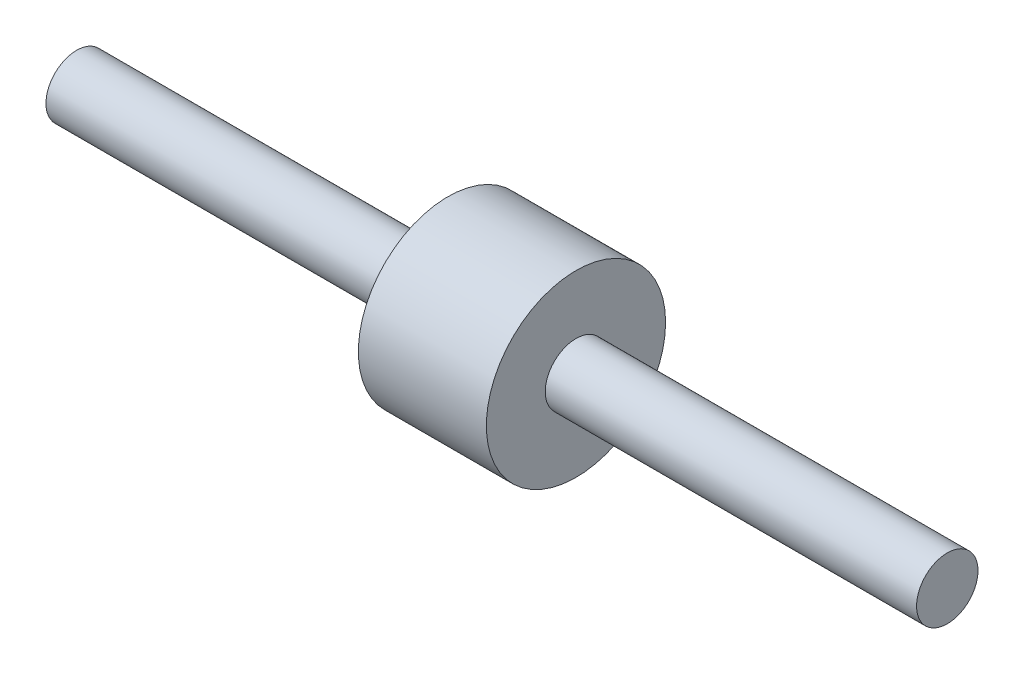
ISO-10303-21;
HEADER;
FILE_DESCRIPTION(('STEP AP214'),'2;1');
FILE_NAME('part.step','',(''),(''),'','','');
FILE_SCHEMA(('AUTOMOTIVE_DESIGN { 1 0 10303 214 1 1 1 1 }'));
ENDSEC;
DATA;
#1=APPLICATION_CONTEXT('core data for automotive mechanical design processes');
#2=APPLICATION_PROTOCOL_DEFINITION('international standard','automotive_design',2000,#1);
#3=PRODUCT_CONTEXT('',#1,'mechanical');
#4=PRODUCT('Part','Part','',(#3));
#5=PRODUCT_RELATED_PRODUCT_CATEGORY('part','',(#4));
#6=PRODUCT_DEFINITION_FORMATION('','',#4);
#7=PRODUCT_DEFINITION_CONTEXT('part definition',#1,'design');
#8=PRODUCT_DEFINITION('design','',#6,#7);
#9=PRODUCT_DEFINITION_SHAPE('','',#8);
#10=(LENGTH_UNIT() NAMED_UNIT(*) SI_UNIT(.MILLI.,.METRE.));
#11=(NAMED_UNIT(*) PLANE_ANGLE_UNIT() SI_UNIT($,.RADIAN.));
#12=(NAMED_UNIT(*) SI_UNIT($,.STERADIAN.) SOLID_ANGLE_UNIT());
#13=UNCERTAINTY_MEASURE_WITH_UNIT(LENGTH_MEASURE(1.E-05),#10,'distance_accuracy_value','');
#14=(GEOMETRIC_REPRESENTATION_CONTEXT(3) GLOBAL_UNCERTAINTY_ASSIGNED_CONTEXT((#13)) GLOBAL_UNIT_ASSIGNED_CONTEXT((#10,
#11,#12)) REPRESENTATION_CONTEXT('',''));
#15=CARTESIAN_POINT('',(0.,0.,0.));
#16=DIRECTION('',(0.,0.,1.));
#17=DIRECTION('',(1.,0.,0.));
#18=AXIS2_PLACEMENT_3D('',#15,#16,#17);
#19=CARTESIAN_POINT('',(12.5,0.,0.));
#20=DIRECTION('',(-1.,0.,0.));
#21=DIRECTION('',(0.,0.,1.));
#22=AXIS2_PLACEMENT_3D('',#19,#20,#21);
#23=CYLINDRICAL_SURFACE('',#22,17.5);
#24=CARTESIAN_POINT('',(12.5,0.,0.));
#25=DIRECTION('',(1.,0.,0.));
#26=DIRECTION('',(0.,0.,-1.));
#27=AXIS2_PLACEMENT_3D('',#24,#25,#26);
#28=CIRCLE('',#27,17.5);
#29=CARTESIAN_POINT('',(12.5,0.,-17.5));
#30=VERTEX_POINT('',#29);
#31=EDGE_CURVE('E10',#30,#30,#28,.T.);
#32=ORIENTED_EDGE('',*,*,#31,.F.);
#33=EDGE_LOOP('',(#32));
#34=FACE_BOUND('',#33,.T.);
#35=CARTESIAN_POINT('',(-12.5,0.,0.));
#36=DIRECTION('',(1.,0.,0.));
#37=DIRECTION('',(0.,0.,-1.));
#38=AXIS2_PLACEMENT_3D('',#35,#36,#37);
#39=CIRCLE('',#38,17.5);
#40=CARTESIAN_POINT('',(-12.5,0.,-17.5));
#41=VERTEX_POINT('',#40);
#42=EDGE_CURVE('E33',#41,#41,#39,.T.);
#43=ORIENTED_EDGE('',*,*,#42,.T.);
#44=EDGE_LOOP('',(#43));
#45=FACE_BOUND('',#44,.T.);
#46=ADVANCED_FACE('F30',(#34,#45),#23,.T.);
#47=CARTESIAN_POINT('',(12.5,0.,0.));
#48=DIRECTION('',(1.,0.,0.));
#49=DIRECTION('',(0.,0.,-1.));
#50=AXIS2_PLACEMENT_3D('',#47,#48,#49);
#51=PLANE('',#50);
#52=CARTESIAN_POINT('',(12.5,0.,0.));
#53=DIRECTION('',(1.,0.,0.));
#54=DIRECTION('',(0.,0.,-1.));
#55=AXIS2_PLACEMENT_3D('',#52,#53,#54);
#56=CIRCLE('',#55,6.);
#57=CARTESIAN_POINT('',(12.5,0.,-6.));
#58=VERTEX_POINT('',#57);
#59=EDGE_CURVE('E42',#58,#58,#56,.T.);
#60=ORIENTED_EDGE('',*,*,#59,.F.);
#61=EDGE_LOOP('',(#60));
#62=FACE_BOUND('',#61,.T.);
#63=ORIENTED_EDGE('',*,*,#31,.T.);
#64=EDGE_LOOP('',(#63));
#65=FACE_BOUND('',#64,.T.);
#66=ADVANCED_FACE('F66',(#62,#65),#51,.T.);
#67=CARTESIAN_POINT('',(-12.5,0.,0.));
#68=DIRECTION('',(1.,0.,0.));
#69=DIRECTION('',(0.,0.,-1.));
#70=AXIS2_PLACEMENT_3D('',#67,#68,#69);
#71=PLANE('',#70);
#72=CARTESIAN_POINT('',(-12.5,0.,0.));
#73=DIRECTION('',(1.,0.,0.));
#74=DIRECTION('',(0.,0.,-1.));
#75=AXIS2_PLACEMENT_3D('',#72,#73,#74);
#76=CIRCLE('',#75,6.);
#77=CARTESIAN_POINT('',(-12.5,0.,-6.));
#78=VERTEX_POINT('',#77);
#79=EDGE_CURVE('E48',#78,#78,#76,.T.);
#80=ORIENTED_EDGE('',*,*,#79,.T.);
#81=EDGE_LOOP('',(#80));
#82=FACE_BOUND('',#81,.T.);
#83=ORIENTED_EDGE('',*,*,#42,.F.);
#84=EDGE_LOOP('',(#83));
#85=FACE_BOUND('',#84,.T.);
#86=ADVANCED_FACE('F71',(#82,#85),#71,.F.);
#87=CARTESIAN_POINT('',(85.,0.,0.));
#88=DIRECTION('',(-1.,0.,0.));
#89=DIRECTION('',(0.,0.,1.));
#90=AXIS2_PLACEMENT_3D('',#87,#88,#89);
#91=CYLINDRICAL_SURFACE('',#90,6.);
#92=CARTESIAN_POINT('',(85.,0.,0.));
#93=DIRECTION('',(1.,0.,0.));
#94=DIRECTION('',(0.,0.,-1.));
#95=AXIS2_PLACEMENT_3D('',#92,#93,#94);
#96=CIRCLE('',#95,6.);
#97=CARTESIAN_POINT('',(85.,0.,-6.));
#98=VERTEX_POINT('',#97);
#99=EDGE_CURVE('E40',#98,#98,#96,.T.);
#100=ORIENTED_EDGE('',*,*,#99,.F.);
#101=EDGE_LOOP('',(#100));
#102=FACE_BOUND('',#101,.T.);
#103=ORIENTED_EDGE('',*,*,#59,.T.);
#104=EDGE_LOOP('',(#103));
#105=FACE_BOUND('',#104,.T.);
#106=ADVANCED_FACE('F78',(#102,#105),#91,.T.);
#107=CARTESIAN_POINT('',(85.,0.,0.));
#108=DIRECTION('',(1.,0.,0.));
#109=DIRECTION('',(0.,0.,-1.));
#110=AXIS2_PLACEMENT_3D('',#107,#108,#109);
#111=PLANE('',#110);
#112=ORIENTED_EDGE('',*,*,#99,.T.);
#113=EDGE_LOOP('',(#112));
#114=FACE_BOUND('',#113,.T.);
#115=ADVANCED_FACE('F63',(#114),#111,.T.);
#116=CARTESIAN_POINT('',(-85.,0.,0.));
#117=DIRECTION('',(1.,0.,0.));
#118=DIRECTION('',(0.,0.,-1.));
#119=AXIS2_PLACEMENT_3D('',#116,#117,#118);
#120=CYLINDRICAL_SURFACE('',#119,6.);
#121=CARTESIAN_POINT('',(-85.,0.,0.));
#122=DIRECTION('',(1.,0.,0.));
#123=DIRECTION('',(0.,0.,-1.));
#124=AXIS2_PLACEMENT_3D('',#121,#122,#123);
#125=CIRCLE('',#124,6.);
#126=CARTESIAN_POINT('',(-85.,0.,-6.));
#127=VERTEX_POINT('',#126);
#128=EDGE_CURVE('E45',#127,#127,#125,.T.);
#129=ORIENTED_EDGE('',*,*,#128,.T.);
#130=EDGE_LOOP('',(#129));
#131=FACE_BOUND('',#130,.T.);
#132=ORIENTED_EDGE('',*,*,#79,.F.);
#133=EDGE_LOOP('',(#132));
#134=FACE_BOUND('',#133,.T.);
#135=ADVANCED_FACE('F54',(#131,#134),#120,.T.);
#136=CARTESIAN_POINT('',(-85.,0.,0.));
#137=DIRECTION('',(-1.,0.,0.));
#138=DIRECTION('',(0.,0.,-1.));
#139=AXIS2_PLACEMENT_3D('',#136,#137,#138);
#140=PLANE('',#139);
#141=ORIENTED_EDGE('',*,*,#128,.F.);
#142=EDGE_LOOP('',(#141));
#143=FACE_BOUND('',#142,.T.);
#144=ADVANCED_FACE('F57',(#143),#140,.T.);
#145=CLOSED_SHELL('',(#46,#66,#86,#106,#115,#135,#144));
#146=MANIFOLD_SOLID_BREP('B2',#145);
#147=ADVANCED_BREP_SHAPE_REPRESENTATION('',(#18,#146),#14);
#148=SHAPE_DEFINITION_REPRESENTATION(#9,#147);
ENDSEC;
END-ISO-10303-21;
